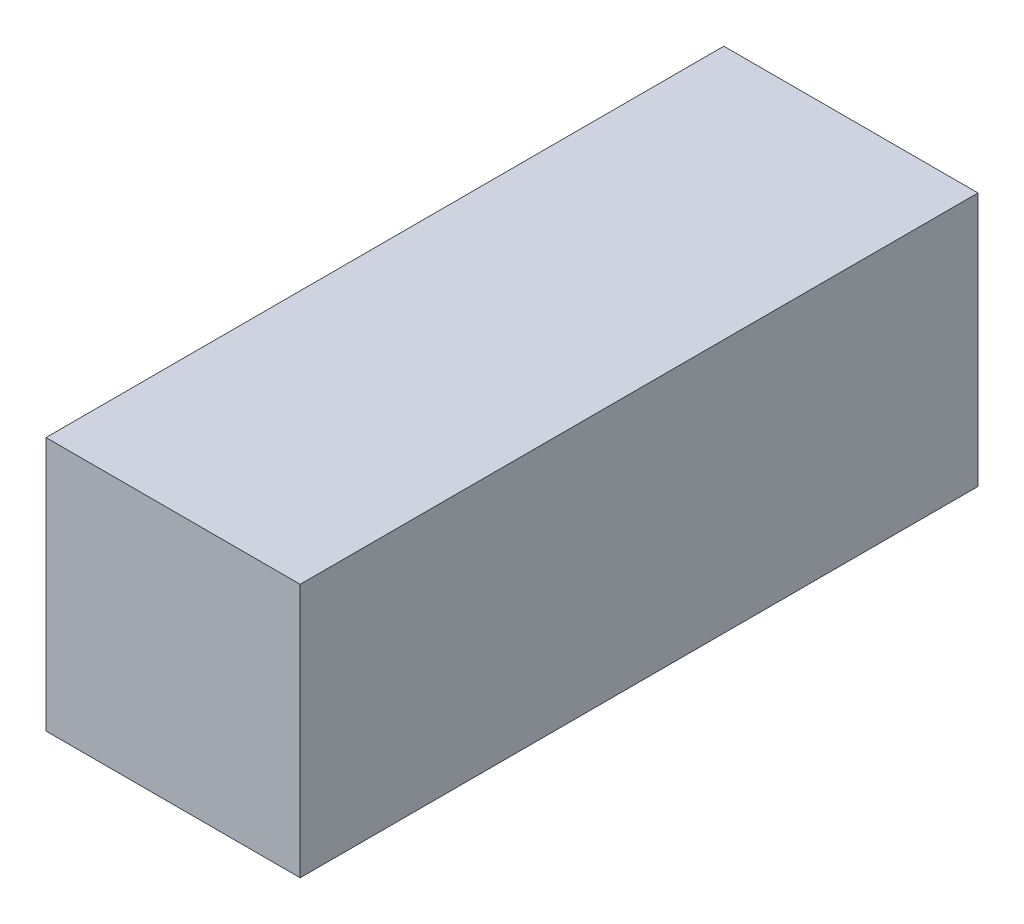
ISO-10303-21;
HEADER;
FILE_DESCRIPTION(('STEP AP214'),'2;1');
FILE_NAME('part.step','',(''),(''),'','','');
FILE_SCHEMA(('AUTOMOTIVE_DESIGN { 1 0 10303 214 1 1 1 1 }'));
ENDSEC;
DATA;
#1=APPLICATION_CONTEXT('core data for automotive mechanical design processes');
#2=APPLICATION_PROTOCOL_DEFINITION('international standard','automotive_design',2000,#1);
#3=PRODUCT_CONTEXT('',#1,'mechanical');
#4=PRODUCT('Part','Part','',(#3));
#5=PRODUCT_RELATED_PRODUCT_CATEGORY('part','',(#4));
#6=PRODUCT_DEFINITION_FORMATION('','',#4);
#7=PRODUCT_DEFINITION_CONTEXT('part definition',#1,'design');
#8=PRODUCT_DEFINITION('design','',#6,#7);
#9=PRODUCT_DEFINITION_SHAPE('','',#8);
#10=(LENGTH_UNIT() NAMED_UNIT(*) SI_UNIT(.MILLI.,.METRE.));
#11=(NAMED_UNIT(*) PLANE_ANGLE_UNIT() SI_UNIT($,.RADIAN.));
#12=(NAMED_UNIT(*) SI_UNIT($,.STERADIAN.) SOLID_ANGLE_UNIT());
#13=UNCERTAINTY_MEASURE_WITH_UNIT(LENGTH_MEASURE(1.E-05),#10,'distance_accuracy_value','');
#14=(GEOMETRIC_REPRESENTATION_CONTEXT(3) GLOBAL_UNCERTAINTY_ASSIGNED_CONTEXT((#13)) GLOBAL_UNIT_ASSIGNED_CONTEXT((#10,
#11,#12)) REPRESENTATION_CONTEXT('',''));
#15=CARTESIAN_POINT('',(0.,0.,0.));
#16=DIRECTION('',(0.,0.,1.));
#17=DIRECTION('',(1.,0.,0.));
#18=AXIS2_PLACEMENT_3D('',#15,#16,#17);
#19=CARTESIAN_POINT('',(0.,0.,800.));
#20=DIRECTION('',(1.,0.,0.));
#21=DIRECTION('',(0.,1.,0.));
#22=AXIS2_PLACEMENT_3D('',#19,#20,#21);
#23=PLANE('',#22);
#24=DIRECTION('',(0.,-1.,0.));
#25=VECTOR('',#24,1.);
#26=CARTESIAN_POINT('',(0.,0.,0.));
#27=LINE('',#26,#25);
#28=CARTESIAN_POINT('',(0.,300.,0.));
#29=VERTEX_POINT('',#28);
#30=CARTESIAN_POINT('',(0.,0.,0.));
#31=VERTEX_POINT('',#30);
#32=EDGE_CURVE('E96',#29,#31,#27,.T.);
#33=ORIENTED_EDGE('',*,*,#32,.T.);
#34=DIRECTION('',(0.,0.,-1.));
#35=VECTOR('',#34,1.);
#36=CARTESIAN_POINT('',(0.,0.,800.));
#37=LINE('',#36,#35);
#38=CARTESIAN_POINT('',(0.,0.,800.));
#39=VERTEX_POINT('',#38);
#40=EDGE_CURVE('E11',#39,#31,#37,.T.);
#41=ORIENTED_EDGE('',*,*,#40,.F.);
#42=DIRECTION('',(0.,-1.,0.));
#43=VECTOR('',#42,1.);
#44=CARTESIAN_POINT('',(0.,0.,800.));
#45=LINE('',#44,#43);
#46=CARTESIAN_POINT('',(0.,300.,800.));
#47=VERTEX_POINT('',#46);
#48=EDGE_CURVE('E84',#47,#39,#45,.T.);
#49=ORIENTED_EDGE('',*,*,#48,.F.);
#50=DIRECTION('',(0.,0.,-1.));
#51=VECTOR('',#50,1.);
#52=CARTESIAN_POINT('',(0.,300.,800.));
#53=LINE('',#52,#51);
#54=EDGE_CURVE('E92',#47,#29,#53,.T.);
#55=ORIENTED_EDGE('',*,*,#54,.T.);
#56=EDGE_LOOP('',(#33,#41,#49,#55));
#57=FACE_BOUND('',#56,.T.);
#58=ADVANCED_FACE('F33',(#57),#23,.F.);
#59=CARTESIAN_POINT('',(0.,0.,800.));
#60=DIRECTION('',(0.,1.,0.));
#61=DIRECTION('',(0.,0.,1.));
#62=AXIS2_PLACEMENT_3D('',#59,#60,#61);
#63=PLANE('',#62);
#64=DIRECTION('',(1.,0.,0.));
#65=VECTOR('',#64,1.);
#66=CARTESIAN_POINT('',(0.,0.,0.));
#67=LINE('',#66,#65);
#68=CARTESIAN_POINT('',(300.,0.,0.));
#69=VERTEX_POINT('',#68);
#70=EDGE_CURVE('E88',#31,#69,#67,.T.);
#71=ORIENTED_EDGE('',*,*,#70,.T.);
#72=DIRECTION('',(0.,0.,-1.));
#73=VECTOR('',#72,1.);
#74=CARTESIAN_POINT('',(300.,0.,800.));
#75=LINE('',#74,#73);
#76=CARTESIAN_POINT('',(300.,0.,800.));
#77=VERTEX_POINT('',#76);
#78=EDGE_CURVE('E41',#77,#69,#75,.T.);
#79=ORIENTED_EDGE('',*,*,#78,.F.);
#80=DIRECTION('',(1.,0.,0.));
#81=VECTOR('',#80,1.);
#82=CARTESIAN_POINT('',(0.,0.,800.));
#83=LINE('',#82,#81);
#84=EDGE_CURVE('E79',#39,#77,#83,.T.);
#85=ORIENTED_EDGE('',*,*,#84,.F.);
#86=ORIENTED_EDGE('',*,*,#40,.T.);
#87=EDGE_LOOP('',(#71,#79,#85,#86));
#88=FACE_BOUND('',#87,.T.);
#89=ADVANCED_FACE('F87',(#88),#63,.F.);
#90=CARTESIAN_POINT('',(300.,0.,800.));
#91=DIRECTION('',(-1.,0.,0.));
#92=DIRECTION('',(0.,-1.,0.));
#93=AXIS2_PLACEMENT_3D('',#90,#91,#92);
#94=PLANE('',#93);
#95=DIRECTION('',(0.,1.,0.));
#96=VECTOR('',#95,1.);
#97=CARTESIAN_POINT('',(300.,0.,0.));
#98=LINE('',#97,#96);
#99=CARTESIAN_POINT('',(300.,300.,0.));
#100=VERTEX_POINT('',#99);
#101=EDGE_CURVE('E66',#69,#100,#98,.T.);
#102=ORIENTED_EDGE('',*,*,#101,.T.);
#103=DIRECTION('',(0.,0.,-1.));
#104=VECTOR('',#103,1.);
#105=CARTESIAN_POINT('',(300.,300.,800.));
#106=LINE('',#105,#104);
#107=CARTESIAN_POINT('',(300.,300.,800.));
#108=VERTEX_POINT('',#107);
#109=EDGE_CURVE('E89',#108,#100,#106,.T.);
#110=ORIENTED_EDGE('',*,*,#109,.F.);
#111=DIRECTION('',(0.,1.,0.));
#112=VECTOR('',#111,1.);
#113=CARTESIAN_POINT('',(300.,0.,800.));
#114=LINE('',#113,#112);
#115=EDGE_CURVE('E82',#77,#108,#114,.T.);
#116=ORIENTED_EDGE('',*,*,#115,.F.);
#117=ORIENTED_EDGE('',*,*,#78,.T.);
#118=EDGE_LOOP('',(#102,#110,#116,#117));
#119=FACE_BOUND('',#118,.T.);
#120=ADVANCED_FACE('F90',(#119),#94,.F.);
#121=CARTESIAN_POINT('',(0.,300.,800.));
#122=DIRECTION('',(0.,-1.,0.));
#123=DIRECTION('',(0.,0.,-1.));
#124=AXIS2_PLACEMENT_3D('',#121,#122,#123);
#125=PLANE('',#124);
#126=DIRECTION('',(-1.,0.,0.));
#127=VECTOR('',#126,1.);
#128=CARTESIAN_POINT('',(0.,300.,0.));
#129=LINE('',#128,#127);
#130=EDGE_CURVE('E72',#100,#29,#129,.T.);
#131=ORIENTED_EDGE('',*,*,#130,.T.);
#132=ORIENTED_EDGE('',*,*,#54,.F.);
#133=DIRECTION('',(-1.,0.,0.));
#134=VECTOR('',#133,1.);
#135=CARTESIAN_POINT('',(0.,300.,800.));
#136=LINE('',#135,#134);
#137=EDGE_CURVE('E49',#108,#47,#136,.T.);
#138=ORIENTED_EDGE('',*,*,#137,.F.);
#139=ORIENTED_EDGE('',*,*,#109,.T.);
#140=EDGE_LOOP('',(#131,#132,#138,#139));
#141=FACE_BOUND('',#140,.T.);
#142=ADVANCED_FACE('F103',(#141),#125,.F.);
#143=CARTESIAN_POINT('',(0.,0.,800.));
#144=DIRECTION('',(0.,0.,-1.));
#145=DIRECTION('',(-1.,0.,0.));
#146=AXIS2_PLACEMENT_3D('',#143,#144,#145);
#147=PLANE('',#146);
#148=ORIENTED_EDGE('',*,*,#48,.T.);
#149=ORIENTED_EDGE('',*,*,#84,.T.);
#150=ORIENTED_EDGE('',*,*,#115,.T.);
#151=ORIENTED_EDGE('',*,*,#137,.T.);
#152=EDGE_LOOP('',(#148,#149,#150,#151));
#153=FACE_BOUND('',#152,.T.);
#154=ADVANCED_FACE('F80',(#153),#147,.F.);
#155=CARTESIAN_POINT('',(0.,0.,0.));
#156=DIRECTION('',(0.,0.,-1.));
#157=DIRECTION('',(-1.,0.,0.));
#158=AXIS2_PLACEMENT_3D('',#155,#156,#157);
#159=PLANE('',#158);
#160=ORIENTED_EDGE('',*,*,#32,.F.);
#161=ORIENTED_EDGE('',*,*,#130,.F.);
#162=ORIENTED_EDGE('',*,*,#101,.F.);
#163=ORIENTED_EDGE('',*,*,#70,.F.);
#164=EDGE_LOOP('',(#160,#161,#162,#163));
#165=FACE_BOUND('',#164,.T.);
#166=ADVANCED_FACE('F106',(#165),#159,.T.);
#167=CLOSED_SHELL('',(#58,#89,#120,#142,#154,#166));
#168=MANIFOLD_SOLID_BREP('B2',#167);
#169=ADVANCED_BREP_SHAPE_REPRESENTATION('',(#18,#168),#14);
#170=SHAPE_DEFINITION_REPRESENTATION(#9,#169);
ENDSEC;
END-ISO-10303-21;
